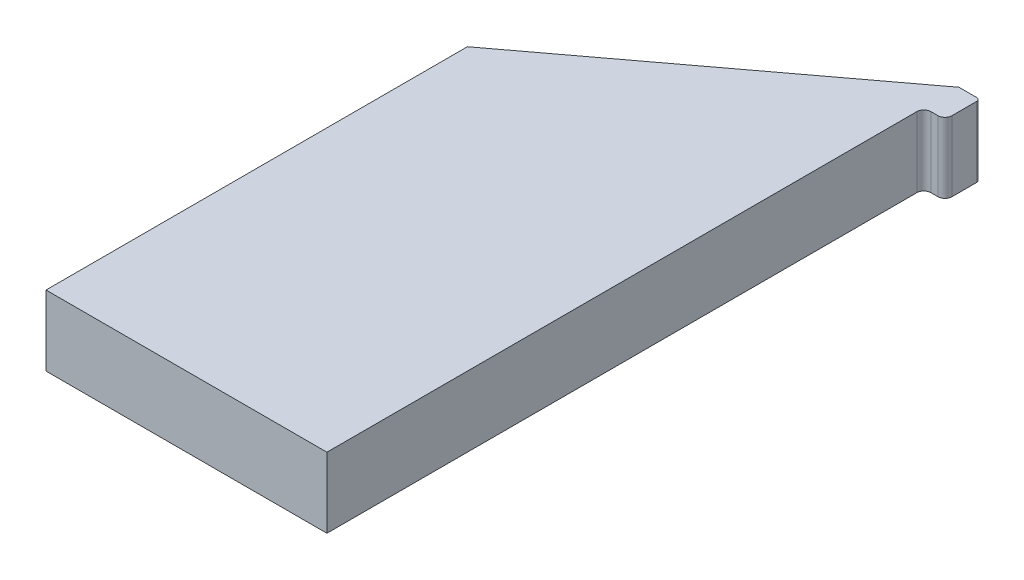
ISO-10303-21;
HEADER;
FILE_DESCRIPTION(('STEP AP214'),'2;1');
FILE_NAME('part.step','',(''),(''),'','','');
FILE_SCHEMA(('AUTOMOTIVE_DESIGN { 1 0 10303 214 1 1 1 1 }'));
ENDSEC;
DATA;
#1=APPLICATION_CONTEXT('core data for automotive mechanical design processes');
#2=APPLICATION_PROTOCOL_DEFINITION('international standard','automotive_design',2000,#1);
#3=PRODUCT_CONTEXT('',#1,'mechanical');
#4=PRODUCT('Part','Part','',(#3));
#5=PRODUCT_RELATED_PRODUCT_CATEGORY('part','',(#4));
#6=PRODUCT_DEFINITION_FORMATION('','',#4);
#7=PRODUCT_DEFINITION_CONTEXT('part definition',#1,'design');
#8=PRODUCT_DEFINITION('design','',#6,#7);
#9=PRODUCT_DEFINITION_SHAPE('','',#8);
#10=(LENGTH_UNIT() NAMED_UNIT(*) SI_UNIT(.MILLI.,.METRE.));
#11=(NAMED_UNIT(*) PLANE_ANGLE_UNIT() SI_UNIT($,.RADIAN.));
#12=(NAMED_UNIT(*) SI_UNIT($,.STERADIAN.) SOLID_ANGLE_UNIT());
#13=UNCERTAINTY_MEASURE_WITH_UNIT(LENGTH_MEASURE(1.E-05),#10,'distance_accuracy_value','');
#14=(GEOMETRIC_REPRESENTATION_CONTEXT(3) GLOBAL_UNCERTAINTY_ASSIGNED_CONTEXT((#13)) GLOBAL_UNIT_ASSIGNED_CONTEXT((#10,
#11,#12)) REPRESENTATION_CONTEXT('',''));
#15=CARTESIAN_POINT('',(0.,0.,0.));
#16=DIRECTION('',(0.,0.,1.));
#17=DIRECTION('',(1.,0.,0.));
#18=AXIS2_PLACEMENT_3D('',#15,#16,#17);
#19=CARTESIAN_POINT('',(10.,5.,15.));
#20=DIRECTION('',(-1.,0.,0.));
#21=DIRECTION('',(0.,0.,1.));
#22=AXIS2_PLACEMENT_3D('',#19,#20,#21);
#23=PLANE('',#22);
#24=DIRECTION('',(0.,1.,0.));
#25=VECTOR('',#24,1.);
#26=CARTESIAN_POINT('',(10.,-3.35410196624968,-27.));
#27=LINE('',#26,#25);
#28=CARTESIAN_POINT('',(10.,0.,-27.));
#29=VERTEX_POINT('',#28);
#30=CARTESIAN_POINT('',(10.,5.,-27.));
#31=VERTEX_POINT('',#30);
#32=EDGE_CURVE('E48',#29,#31,#27,.T.);
#33=ORIENTED_EDGE('',*,*,#32,.T.);
#34=DIRECTION('',(0.,0.,-1.));
#35=VECTOR('',#34,1.);
#36=CARTESIAN_POINT('',(10.,5.,-30.));
#37=LINE('',#36,#35);
#38=CARTESIAN_POINT('',(10.,5.,15.));
#39=VERTEX_POINT('',#38);
#40=EDGE_CURVE('E131',#39,#31,#37,.T.);
#41=ORIENTED_EDGE('',*,*,#40,.F.);
#42=DIRECTION('',(0.,-1.,0.));
#43=VECTOR('',#42,1.);
#44=CARTESIAN_POINT('',(10.,5.,15.));
#45=LINE('',#44,#43);
#46=CARTESIAN_POINT('',(10.,0.,15.));
#47=VERTEX_POINT('',#46);
#48=EDGE_CURVE('E165',#39,#47,#45,.T.);
#49=ORIENTED_EDGE('',*,*,#48,.T.);
#50=DIRECTION('',(0.,0.,-1.));
#51=VECTOR('',#50,1.);
#52=CARTESIAN_POINT('',(10.,0.,15.));
#53=LINE('',#52,#51);
#54=EDGE_CURVE('E53',#47,#29,#53,.T.);
#55=ORIENTED_EDGE('',*,*,#54,.T.);
#56=EDGE_LOOP('',(#33,#41,#49,#55));
#57=FACE_BOUND('',#56,.T.);
#58=ADVANCED_FACE('F33',(#57),#23,.F.);
#59=CARTESIAN_POINT('',(-10.,5.,-15.));
#60=DIRECTION('',(0.6,0.,0.8));
#61=DIRECTION('',(0.8,0.,-0.6));
#62=AXIS2_PLACEMENT_3D('',#59,#60,#61);
#63=PLANE('',#62);
#64=DIRECTION('',(-0.8,0.,0.6));
#65=VECTOR('',#64,1.);
#66=CARTESIAN_POINT('',(-10.,0.,-15.));
#67=LINE('',#66,#65);
#68=CARTESIAN_POINT('',(10.,0.,-30.));
#69=VERTEX_POINT('',#68);
#70=CARTESIAN_POINT('',(-10.,0.,-15.));
#71=VERTEX_POINT('',#70);
#72=EDGE_CURVE('E157',#69,#71,#67,.T.);
#73=ORIENTED_EDGE('',*,*,#72,.T.);
#74=DIRECTION('',(0.,-1.,0.));
#75=VECTOR('',#74,1.);
#76=CARTESIAN_POINT('',(-10.,5.,-15.));
#77=LINE('',#76,#75);
#78=CARTESIAN_POINT('',(-10.,5.,-15.));
#79=VERTEX_POINT('',#78);
#80=EDGE_CURVE('E41',#79,#71,#77,.T.);
#81=ORIENTED_EDGE('',*,*,#80,.F.);
#82=DIRECTION('',(-0.8,0.,0.6));
#83=VECTOR('',#82,1.);
#84=CARTESIAN_POINT('',(-10.,5.,-15.));
#85=LINE('',#84,#83);
#86=CARTESIAN_POINT('',(10.,5.,-30.));
#87=VERTEX_POINT('',#86);
#88=EDGE_CURVE('E159',#87,#79,#85,.T.);
#89=ORIENTED_EDGE('',*,*,#88,.F.);
#90=DIRECTION('',(0.,-1.,0.));
#91=VECTOR('',#90,1.);
#92=CARTESIAN_POINT('',(10.,5.,-30.));
#93=LINE('',#92,#91);
#94=EDGE_CURVE('E11',#87,#69,#93,.T.);
#95=ORIENTED_EDGE('',*,*,#94,.T.);
#96=EDGE_LOOP('',(#73,#81,#89,#95));
#97=FACE_BOUND('',#96,.T.);
#98=ADVANCED_FACE('F35',(#97),#63,.F.);
#99=CARTESIAN_POINT('',(-10.,5.,15.));
#100=DIRECTION('',(1.,0.,0.));
#101=DIRECTION('',(0.,0.,-1.));
#102=AXIS2_PLACEMENT_3D('',#99,#100,#101);
#103=PLANE('',#102);
#104=DIRECTION('',(0.,0.,1.));
#105=VECTOR('',#104,1.);
#106=CARTESIAN_POINT('',(-10.,0.,15.));
#107=LINE('',#106,#105);
#108=CARTESIAN_POINT('',(-10.,0.,15.));
#109=VERTEX_POINT('',#108);
#110=EDGE_CURVE('E167',#71,#109,#107,.T.);
#111=ORIENTED_EDGE('',*,*,#110,.T.);
#112=DIRECTION('',(0.,-1.,0.));
#113=VECTOR('',#112,1.);
#114=CARTESIAN_POINT('',(-10.,5.,15.));
#115=LINE('',#114,#113);
#116=CARTESIAN_POINT('',(-10.,5.,15.));
#117=VERTEX_POINT('',#116);
#118=EDGE_CURVE('E173',#117,#109,#115,.T.);
#119=ORIENTED_EDGE('',*,*,#118,.F.);
#120=DIRECTION('',(0.,0.,1.));
#121=VECTOR('',#120,1.);
#122=CARTESIAN_POINT('',(-10.,5.,15.));
#123=LINE('',#122,#121);
#124=EDGE_CURVE('E161',#79,#117,#123,.T.);
#125=ORIENTED_EDGE('',*,*,#124,.F.);
#126=ORIENTED_EDGE('',*,*,#80,.T.);
#127=EDGE_LOOP('',(#111,#119,#125,#126));
#128=FACE_BOUND('',#127,.T.);
#129=ADVANCED_FACE('F180',(#128),#103,.F.);
#130=CARTESIAN_POINT('',(-10.,5.,15.));
#131=DIRECTION('',(0.,0.,-1.));
#132=DIRECTION('',(-1.,0.,0.));
#133=AXIS2_PLACEMENT_3D('',#130,#131,#132);
#134=PLANE('',#133);
#135=DIRECTION('',(1.,0.,0.));
#136=VECTOR('',#135,1.);
#137=CARTESIAN_POINT('',(-10.,0.,15.));
#138=LINE('',#137,#136);
#139=EDGE_CURVE('E169',#109,#47,#138,.T.);
#140=ORIENTED_EDGE('',*,*,#139,.T.);
#141=ORIENTED_EDGE('',*,*,#48,.F.);
#142=DIRECTION('',(1.,0.,0.));
#143=VECTOR('',#142,1.);
#144=CARTESIAN_POINT('',(-10.,5.,15.));
#145=LINE('',#144,#143);
#146=EDGE_CURVE('E163',#117,#39,#145,.T.);
#147=ORIENTED_EDGE('',*,*,#146,.F.);
#148=ORIENTED_EDGE('',*,*,#118,.T.);
#149=EDGE_LOOP('',(#140,#141,#147,#148));
#150=FACE_BOUND('',#149,.T.);
#151=ADVANCED_FACE('F190',(#150),#134,.F.);
#152=CARTESIAN_POINT('',(0.,5.,0.));
#153=DIRECTION('',(0.,1.,0.));
#154=DIRECTION('',(0.,0.,1.));
#155=AXIS2_PLACEMENT_3D('',#152,#153,#154);
#156=PLANE('',#155);
#157=ORIENTED_EDGE('',*,*,#40,.T.);
#158=CARTESIAN_POINT('',(10.5,5.,-27.));
#159=DIRECTION('',(0.,-1.,0.));
#160=DIRECTION('',(0.,0.,1.));
#161=AXIS2_PLACEMENT_3D('',#158,#159,#160);
#162=CIRCLE('',#161,0.499999999999997);
#163=CARTESIAN_POINT('',(10.5,5.,-27.5));
#164=VERTEX_POINT('',#163);
#165=EDGE_CURVE('E114',#31,#164,#162,.T.);
#166=ORIENTED_EDGE('',*,*,#165,.T.);
#167=DIRECTION('',(1.,0.,0.));
#168=VECTOR('',#167,1.);
#169=CARTESIAN_POINT('',(11.,5.,-27.5));
#170=LINE('',#169,#168);
#171=CARTESIAN_POINT('',(11.,5.,-27.5));
#172=VERTEX_POINT('',#171);
#173=EDGE_CURVE('E121',#164,#172,#170,.T.);
#174=ORIENTED_EDGE('',*,*,#173,.T.);
#175=CARTESIAN_POINT('',(11.,5.,-28.));
#176=DIRECTION('',(0.,1.,0.));
#177=DIRECTION('',(0.,0.,-1.));
#178=AXIS2_PLACEMENT_3D('',#175,#176,#177);
#179=CIRCLE('',#178,0.5);
#180=CARTESIAN_POINT('',(11.5,5.,-28.));
#181=VERTEX_POINT('',#180);
#182=EDGE_CURVE('E127',#172,#181,#179,.T.);
#183=ORIENTED_EDGE('',*,*,#182,.T.);
#184=DIRECTION('',(0.,0.,-1.));
#185=VECTOR('',#184,1.);
#186=CARTESIAN_POINT('',(11.5,5.,-29.75));
#187=LINE('',#186,#185);
#188=CARTESIAN_POINT('',(11.5,5.,-29.75));
#189=VERTEX_POINT('',#188);
#190=EDGE_CURVE('E138',#181,#189,#187,.T.);
#191=ORIENTED_EDGE('',*,*,#190,.T.);
#192=CARTESIAN_POINT('',(11.25,5.,-29.75));
#193=DIRECTION('',(0.,1.,0.));
#194=DIRECTION('',(0.,0.,1.));
#195=AXIS2_PLACEMENT_3D('',#192,#193,#194);
#196=CIRCLE('',#195,0.25);
#197=CARTESIAN_POINT('',(11.25,5.,-30.));
#198=VERTEX_POINT('',#197);
#199=EDGE_CURVE('E141',#189,#198,#196,.T.);
#200=ORIENTED_EDGE('',*,*,#199,.T.);
#201=DIRECTION('',(-1.,0.,0.));
#202=VECTOR('',#201,1.);
#203=CARTESIAN_POINT('',(10.,5.,-30.));
#204=LINE('',#203,#202);
#205=EDGE_CURVE('E144',#198,#87,#204,.T.);
#206=ORIENTED_EDGE('',*,*,#205,.T.);
#207=ORIENTED_EDGE('',*,*,#88,.T.);
#208=ORIENTED_EDGE('',*,*,#124,.T.);
#209=ORIENTED_EDGE('',*,*,#146,.T.);
#210=EDGE_LOOP('',(#157,#166,#174,#183,#191,#200,#206,#207,#208,#209));
#211=FACE_BOUND('',#210,.T.);
#212=ADVANCED_FACE('F129',(#211),#156,.T.);
#213=CARTESIAN_POINT('',(0.,0.,0.));
#214=DIRECTION('',(0.,1.,0.));
#215=DIRECTION('',(0.,0.,1.));
#216=AXIS2_PLACEMENT_3D('',#213,#214,#215);
#217=PLANE('',#216);
#218=ORIENTED_EDGE('',*,*,#72,.F.);
#219=DIRECTION('',(1.,0.,0.));
#220=VECTOR('',#219,1.);
#221=CARTESIAN_POINT('',(10.,0.,-30.));
#222=LINE('',#221,#220);
#223=CARTESIAN_POINT('',(11.25,0.,-30.));
#224=VERTEX_POINT('',#223);
#225=EDGE_CURVE('E134',#69,#224,#222,.T.);
#226=ORIENTED_EDGE('',*,*,#225,.T.);
#227=CARTESIAN_POINT('',(11.25,0.,-29.75));
#228=DIRECTION('',(0.,1.,0.));
#229=DIRECTION('',(0.,0.,1.));
#230=AXIS2_PLACEMENT_3D('',#227,#228,#229);
#231=CIRCLE('',#230,0.25);
#232=CARTESIAN_POINT('',(11.5,0.,-29.75));
#233=VERTEX_POINT('',#232);
#234=EDGE_CURVE('E198',#224,#233,#231,.F.);
#235=ORIENTED_EDGE('',*,*,#234,.T.);
#236=DIRECTION('',(0.,0.,1.));
#237=VECTOR('',#236,1.);
#238=CARTESIAN_POINT('',(11.5,0.,-29.75));
#239=LINE('',#238,#237);
#240=CARTESIAN_POINT('',(11.5,0.,-28.));
#241=VERTEX_POINT('',#240);
#242=EDGE_CURVE('E199',#233,#241,#239,.T.);
#243=ORIENTED_EDGE('',*,*,#242,.T.);
#244=CARTESIAN_POINT('',(11.,0.,-28.));
#245=DIRECTION('',(0.,1.,0.));
#246=DIRECTION('',(0.,0.,1.));
#247=AXIS2_PLACEMENT_3D('',#244,#245,#246);
#248=CIRCLE('',#247,0.5);
#249=CARTESIAN_POINT('',(11.,0.,-27.5));
#250=VERTEX_POINT('',#249);
#251=EDGE_CURVE('E201',#241,#250,#248,.F.);
#252=ORIENTED_EDGE('',*,*,#251,.T.);
#253=DIRECTION('',(-1.,0.,0.));
#254=VECTOR('',#253,1.);
#255=CARTESIAN_POINT('',(11.,0.,-27.5));
#256=LINE('',#255,#254);
#257=CARTESIAN_POINT('',(10.5,0.,-27.5));
#258=VERTEX_POINT('',#257);
#259=EDGE_CURVE('E149',#250,#258,#256,.T.);
#260=ORIENTED_EDGE('',*,*,#259,.T.);
#261=CARTESIAN_POINT('',(10.5,0.,-27.));
#262=DIRECTION('',(0.,1.,0.));
#263=DIRECTION('',(0.,0.,1.));
#264=AXIS2_PLACEMENT_3D('',#261,#262,#263);
#265=CIRCLE('',#264,0.499999999999997);
#266=EDGE_CURVE('E115',#258,#29,#265,.T.);
#267=ORIENTED_EDGE('',*,*,#266,.T.);
#268=ORIENTED_EDGE('',*,*,#54,.F.);
#269=ORIENTED_EDGE('',*,*,#139,.F.);
#270=ORIENTED_EDGE('',*,*,#110,.F.);
#271=EDGE_LOOP('',(#218,#226,#235,#243,#252,#260,#267,#268,#269,#270));
#272=FACE_BOUND('',#271,.T.);
#273=ADVANCED_FACE('F186',(#272),#217,.F.);
#274=CARTESIAN_POINT('',(10.,-3.35410196624968,-30.));
#275=DIRECTION('',(0.,0.,-1.));
#276=DIRECTION('',(-1.,0.,0.));
#277=AXIS2_PLACEMENT_3D('',#274,#275,#276);
#278=PLANE('',#277);
#279=ORIENTED_EDGE('',*,*,#225,.F.);
#280=ORIENTED_EDGE('',*,*,#94,.F.);
#281=ORIENTED_EDGE('',*,*,#205,.F.);
#282=DIRECTION('',(0.,1.,0.));
#283=VECTOR('',#282,1.);
#284=CARTESIAN_POINT('',(11.25,-3.35410196624968,-30.));
#285=LINE('',#284,#283);
#286=EDGE_CURVE('E147',#224,#198,#285,.T.);
#287=ORIENTED_EDGE('',*,*,#286,.F.);
#288=EDGE_LOOP('',(#279,#280,#281,#287));
#289=FACE_BOUND('',#288,.T.);
#290=ADVANCED_FACE('F195',(#289),#278,.T.);
#291=CARTESIAN_POINT('',(11.25,-3.35410196624968,-29.75));
#292=DIRECTION('',(0.,1.,0.));
#293=DIRECTION('',(0.,0.,1.));
#294=AXIS2_PLACEMENT_3D('',#291,#292,#293);
#295=CYLINDRICAL_SURFACE('',#294,0.25);
#296=ORIENTED_EDGE('',*,*,#234,.F.);
#297=ORIENTED_EDGE('',*,*,#286,.T.);
#298=ORIENTED_EDGE('',*,*,#199,.F.);
#299=DIRECTION('',(0.,1.,0.));
#300=VECTOR('',#299,1.);
#301=CARTESIAN_POINT('',(11.5,-3.35410196624968,-29.75));
#302=LINE('',#301,#300);
#303=EDGE_CURVE('E150',#233,#189,#302,.T.);
#304=ORIENTED_EDGE('',*,*,#303,.F.);
#305=EDGE_LOOP('',(#296,#297,#298,#304));
#306=FACE_BOUND('',#305,.T.);
#307=ADVANCED_FACE('F215',(#306),#295,.T.);
#308=CARTESIAN_POINT('',(11.5,-3.35410196624968,-29.75));
#309=DIRECTION('',(1.,0.,0.));
#310=DIRECTION('',(0.,0.,-1.));
#311=AXIS2_PLACEMENT_3D('',#308,#309,#310);
#312=PLANE('',#311);
#313=ORIENTED_EDGE('',*,*,#242,.F.);
#314=ORIENTED_EDGE('',*,*,#303,.T.);
#315=ORIENTED_EDGE('',*,*,#190,.F.);
#316=DIRECTION('',(0.,1.,0.));
#317=VECTOR('',#316,1.);
#318=CARTESIAN_POINT('',(11.5,-3.35410196624968,-28.));
#319=LINE('',#318,#317);
#320=EDGE_CURVE('E152',#241,#181,#319,.T.);
#321=ORIENTED_EDGE('',*,*,#320,.F.);
#322=EDGE_LOOP('',(#313,#314,#315,#321));
#323=FACE_BOUND('',#322,.T.);
#324=ADVANCED_FACE('F212',(#323),#312,.T.);
#325=CARTESIAN_POINT('',(11.,-3.35410196624968,-28.));
#326=DIRECTION('',(0.,1.,0.));
#327=DIRECTION('',(0.,0.,1.));
#328=AXIS2_PLACEMENT_3D('',#325,#326,#327);
#329=CYLINDRICAL_SURFACE('',#328,0.5);
#330=ORIENTED_EDGE('',*,*,#251,.F.);
#331=ORIENTED_EDGE('',*,*,#320,.T.);
#332=ORIENTED_EDGE('',*,*,#182,.F.);
#333=DIRECTION('',(0.,1.,0.));
#334=VECTOR('',#333,1.);
#335=CARTESIAN_POINT('',(11.,-3.35410196624968,-27.5));
#336=LINE('',#335,#334);
#337=EDGE_CURVE('E118',#250,#172,#336,.T.);
#338=ORIENTED_EDGE('',*,*,#337,.F.);
#339=EDGE_LOOP('',(#330,#331,#332,#338));
#340=FACE_BOUND('',#339,.T.);
#341=ADVANCED_FACE('F207',(#340),#329,.T.);
#342=CARTESIAN_POINT('',(11.,-3.35410196624968,-27.5));
#343=DIRECTION('',(0.,0.,1.));
#344=DIRECTION('',(1.,0.,0.));
#345=AXIS2_PLACEMENT_3D('',#342,#343,#344);
#346=PLANE('',#345);
#347=ORIENTED_EDGE('',*,*,#259,.F.);
#348=ORIENTED_EDGE('',*,*,#337,.T.);
#349=ORIENTED_EDGE('',*,*,#173,.F.);
#350=DIRECTION('',(0.,1.,0.));
#351=VECTOR('',#350,1.);
#352=CARTESIAN_POINT('',(10.5,-3.35410196624968,-27.5));
#353=LINE('',#352,#351);
#354=EDGE_CURVE('E110',#258,#164,#353,.T.);
#355=ORIENTED_EDGE('',*,*,#354,.F.);
#356=EDGE_LOOP('',(#347,#348,#349,#355));
#357=FACE_BOUND('',#356,.T.);
#358=ADVANCED_FACE('F122',(#357),#346,.T.);
#359=CARTESIAN_POINT('',(10.5,-3.35410196624968,-27.));
#360=DIRECTION('',(0.,1.,0.));
#361=DIRECTION('',(0.,0.,1.));
#362=AXIS2_PLACEMENT_3D('',#359,#360,#361);
#363=CYLINDRICAL_SURFACE('',#362,0.499999999999997);
#364=ORIENTED_EDGE('',*,*,#266,.F.);
#365=ORIENTED_EDGE('',*,*,#354,.T.);
#366=ORIENTED_EDGE('',*,*,#165,.F.);
#367=ORIENTED_EDGE('',*,*,#32,.F.);
#368=EDGE_LOOP('',(#364,#365,#366,#367));
#369=FACE_BOUND('',#368,.T.);
#370=ADVANCED_FACE('F112',(#369),#363,.F.);
#371=CLOSED_SHELL('',(#58,#98,#129,#151,#212,#273,#290,#307,#324,#341,#358,#370));
#372=MANIFOLD_SOLID_BREP('B2',#371);
#373=ADVANCED_BREP_SHAPE_REPRESENTATION('',(#18,#372),#14);
#374=SHAPE_DEFINITION_REPRESENTATION(#9,#373);
ENDSEC;
END-ISO-10303-21;
